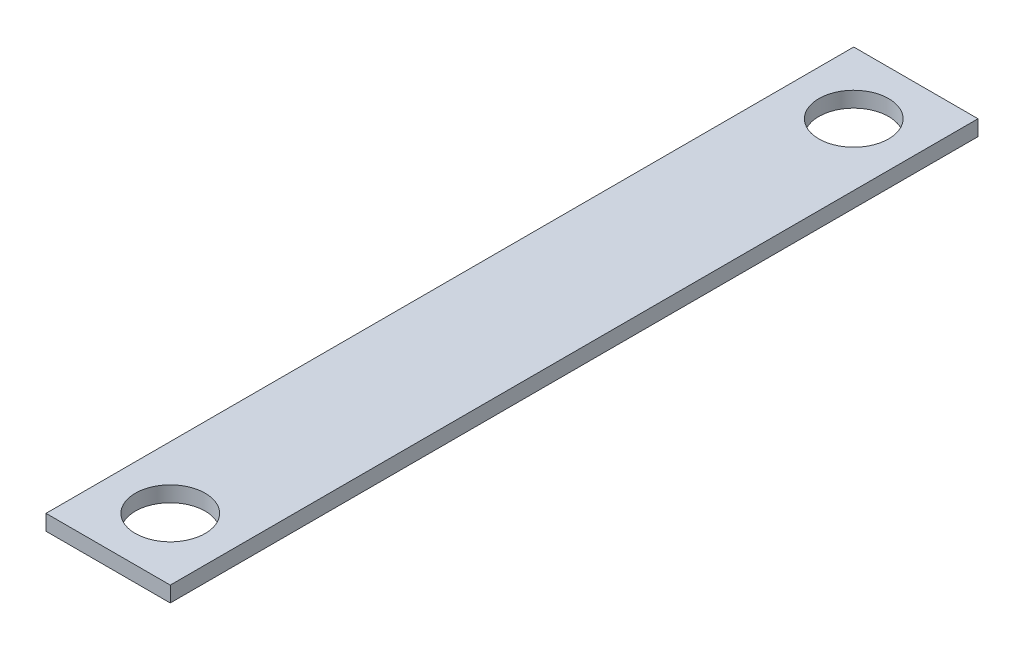
ISO-10303-21;
HEADER;
FILE_DESCRIPTION(('STEP AP214'),'2;1');
FILE_NAME('part.step','',(''),(''),'','','');
FILE_SCHEMA(('AUTOMOTIVE_DESIGN { 1 0 10303 214 1 1 1 1 }'));
ENDSEC;
DATA;
#1=APPLICATION_CONTEXT('core data for automotive mechanical design processes');
#2=APPLICATION_PROTOCOL_DEFINITION('international standard','automotive_design',2000,#1);
#3=PRODUCT_CONTEXT('',#1,'mechanical');
#4=PRODUCT('Part','Part','',(#3));
#5=PRODUCT_RELATED_PRODUCT_CATEGORY('part','',(#4));
#6=PRODUCT_DEFINITION_FORMATION('','',#4);
#7=PRODUCT_DEFINITION_CONTEXT('part definition',#1,'design');
#8=PRODUCT_DEFINITION('design','',#6,#7);
#9=PRODUCT_DEFINITION_SHAPE('','',#8);
#10=(LENGTH_UNIT() NAMED_UNIT(*) SI_UNIT(.MILLI.,.METRE.));
#11=(NAMED_UNIT(*) PLANE_ANGLE_UNIT() SI_UNIT($,.RADIAN.));
#12=(NAMED_UNIT(*) SI_UNIT($,.STERADIAN.) SOLID_ANGLE_UNIT());
#13=UNCERTAINTY_MEASURE_WITH_UNIT(LENGTH_MEASURE(1.E-05),#10,'distance_accuracy_value','');
#14=(GEOMETRIC_REPRESENTATION_CONTEXT(3) GLOBAL_UNCERTAINTY_ASSIGNED_CONTEXT((#13)) GLOBAL_UNIT_ASSIGNED_CONTEXT((#10,
#11,#12)) REPRESENTATION_CONTEXT('',''));
#15=CARTESIAN_POINT('',(0.,0.,0.));
#16=DIRECTION('',(0.,0.,1.));
#17=DIRECTION('',(1.,0.,0.));
#18=AXIS2_PLACEMENT_3D('',#15,#16,#17);
#19=CARTESIAN_POINT('',(0.,6.35,0.));
#20=DIRECTION('',(-1.,0.,0.));
#21=DIRECTION('',(0.,0.,1.));
#22=AXIS2_PLACEMENT_3D('',#19,#20,#21);
#23=PLANE('',#22);
#24=DIRECTION('',(0.,0.,-1.));
#25=VECTOR('',#24,1.);
#26=CARTESIAN_POINT('',(0.,0.,0.));
#27=LINE('',#26,#25);
#28=CARTESIAN_POINT('',(0.,0.,0.));
#29=VERTEX_POINT('',#28);
#30=CARTESIAN_POINT('',(0.,0.,-330.2));
#31=VERTEX_POINT('',#30);
#32=EDGE_CURVE('E109',#29,#31,#27,.T.);
#33=ORIENTED_EDGE('',*,*,#32,.F.);
#34=DIRECTION('',(0.,-1.,0.));
#35=VECTOR('',#34,1.);
#36=CARTESIAN_POINT('',(0.,6.35,0.));
#37=LINE('',#36,#35);
#38=CARTESIAN_POINT('',(0.,6.35,0.));
#39=VERTEX_POINT('',#38);
#40=EDGE_CURVE('E11',#39,#29,#37,.T.);
#41=ORIENTED_EDGE('',*,*,#40,.F.);
#42=DIRECTION('',(0.,0.,-1.));
#43=VECTOR('',#42,1.);
#44=CARTESIAN_POINT('',(0.,6.35,0.));
#45=LINE('',#44,#43);
#46=CARTESIAN_POINT('',(0.,6.35,-330.2));
#47=VERTEX_POINT('',#46);
#48=EDGE_CURVE('E89',#39,#47,#45,.T.);
#49=ORIENTED_EDGE('',*,*,#48,.T.);
#50=DIRECTION('',(0.,-1.,0.));
#51=VECTOR('',#50,1.);
#52=CARTESIAN_POINT('',(0.,6.35,-330.2));
#53=LINE('',#52,#51);
#54=EDGE_CURVE('E50',#47,#31,#53,.T.);
#55=ORIENTED_EDGE('',*,*,#54,.T.);
#56=EDGE_LOOP('',(#33,#41,#49,#55));
#57=FACE_BOUND('',#56,.T.);
#58=ADVANCED_FACE('F33',(#57),#23,.T.);
#59=CARTESIAN_POINT('',(0.,6.35,0.));
#60=DIRECTION('',(0.,0.,-1.));
#61=DIRECTION('',(-1.,0.,0.));
#62=AXIS2_PLACEMENT_3D('',#59,#60,#61);
#63=PLANE('',#62);
#64=DIRECTION('',(1.,0.,0.));
#65=VECTOR('',#64,1.);
#66=CARTESIAN_POINT('',(0.,0.,0.));
#67=LINE('',#66,#65);
#68=CARTESIAN_POINT('',(50.8,0.,0.));
#69=VERTEX_POINT('',#68);
#70=EDGE_CURVE('E94',#29,#69,#67,.T.);
#71=ORIENTED_EDGE('',*,*,#70,.T.);
#72=DIRECTION('',(0.,-1.,0.));
#73=VECTOR('',#72,1.);
#74=CARTESIAN_POINT('',(50.8,6.35,0.));
#75=LINE('',#74,#73);
#76=CARTESIAN_POINT('',(50.8,6.35,0.));
#77=VERTEX_POINT('',#76);
#78=EDGE_CURVE('E42',#77,#69,#75,.T.);
#79=ORIENTED_EDGE('',*,*,#78,.F.);
#80=DIRECTION('',(1.,0.,0.));
#81=VECTOR('',#80,1.);
#82=CARTESIAN_POINT('',(0.,6.35,0.));
#83=LINE('',#82,#81);
#84=EDGE_CURVE('E84',#39,#77,#83,.T.);
#85=ORIENTED_EDGE('',*,*,#84,.F.);
#86=ORIENTED_EDGE('',*,*,#40,.T.);
#87=EDGE_LOOP('',(#71,#79,#85,#86));
#88=FACE_BOUND('',#87,.T.);
#89=ADVANCED_FACE('F92',(#88),#63,.F.);
#90=CARTESIAN_POINT('',(50.8,6.35,0.));
#91=DIRECTION('',(-1.,0.,0.));
#92=DIRECTION('',(0.,0.,1.));
#93=AXIS2_PLACEMENT_3D('',#90,#91,#92);
#94=PLANE('',#93);
#95=DIRECTION('',(0.,0.,-1.));
#96=VECTOR('',#95,1.);
#97=CARTESIAN_POINT('',(50.8,0.,0.));
#98=LINE('',#97,#96);
#99=CARTESIAN_POINT('',(50.8,0.,-330.2));
#100=VERTEX_POINT('',#99);
#101=EDGE_CURVE('E106',#69,#100,#98,.T.);
#102=ORIENTED_EDGE('',*,*,#101,.T.);
#103=DIRECTION('',(0.,-1.,0.));
#104=VECTOR('',#103,1.);
#105=CARTESIAN_POINT('',(50.8,6.35,-330.2));
#106=LINE('',#105,#104);
#107=CARTESIAN_POINT('',(50.8,6.35,-330.2));
#108=VERTEX_POINT('',#107);
#109=EDGE_CURVE('E64',#108,#100,#106,.T.);
#110=ORIENTED_EDGE('',*,*,#109,.F.);
#111=DIRECTION('',(0.,0.,-1.));
#112=VECTOR('',#111,1.);
#113=CARTESIAN_POINT('',(50.8,6.35,0.));
#114=LINE('',#113,#112);
#115=EDGE_CURVE('E76',#77,#108,#114,.T.);
#116=ORIENTED_EDGE('',*,*,#115,.F.);
#117=ORIENTED_EDGE('',*,*,#78,.T.);
#118=EDGE_LOOP('',(#102,#110,#116,#117));
#119=FACE_BOUND('',#118,.T.);
#120=ADVANCED_FACE('F78',(#119),#94,.F.);
#121=CARTESIAN_POINT('',(0.,6.35,-330.2));
#122=DIRECTION('',(0.,0.,-1.));
#123=DIRECTION('',(-1.,0.,0.));
#124=AXIS2_PLACEMENT_3D('',#121,#122,#123);
#125=PLANE('',#124);
#126=DIRECTION('',(1.,0.,0.));
#127=VECTOR('',#126,1.);
#128=CARTESIAN_POINT('',(0.,0.,-330.2));
#129=LINE('',#128,#127);
#130=EDGE_CURVE('E103',#31,#100,#129,.T.);
#131=ORIENTED_EDGE('',*,*,#130,.F.);
#132=ORIENTED_EDGE('',*,*,#54,.F.);
#133=DIRECTION('',(1.,0.,0.));
#134=VECTOR('',#133,1.);
#135=CARTESIAN_POINT('',(0.,6.35,-330.2));
#136=LINE('',#135,#134);
#137=EDGE_CURVE('E83',#47,#108,#136,.T.);
#138=ORIENTED_EDGE('',*,*,#137,.T.);
#139=ORIENTED_EDGE('',*,*,#109,.T.);
#140=EDGE_LOOP('',(#131,#132,#138,#139));
#141=FACE_BOUND('',#140,.T.);
#142=ADVANCED_FACE('F143',(#141),#125,.T.);
#143=CARTESIAN_POINT('',(25.4,6.35,-25.4));
#144=DIRECTION('',(0.,-1.,0.));
#145=DIRECTION('',(0.,0.,-1.));
#146=AXIS2_PLACEMENT_3D('',#143,#144,#145);
#147=CYLINDRICAL_SURFACE('',#146,14.2748);
#148=CARTESIAN_POINT('',(25.4,6.35,-25.4));
#149=DIRECTION('',(0.,1.,0.));
#150=DIRECTION('',(0.,0.,1.));
#151=AXIS2_PLACEMENT_3D('',#148,#149,#150);
#152=CIRCLE('',#151,14.2748);
#153=CARTESIAN_POINT('',(25.4,6.35,-11.1252));
#154=VERTEX_POINT('',#153);
#155=EDGE_CURVE('E102',#154,#154,#152,.T.);
#156=ORIENTED_EDGE('',*,*,#155,.T.);
#157=EDGE_LOOP('',(#156));
#158=FACE_BOUND('',#157,.T.);
#159=CARTESIAN_POINT('',(25.4,0.,-25.4));
#160=DIRECTION('',(0.,1.,0.));
#161=DIRECTION('',(0.,0.,1.));
#162=AXIS2_PLACEMENT_3D('',#159,#160,#161);
#163=CIRCLE('',#162,14.2748);
#164=CARTESIAN_POINT('',(25.4,0.,-11.1252));
#165=VERTEX_POINT('',#164);
#166=EDGE_CURVE('E111',#165,#165,#163,.T.);
#167=ORIENTED_EDGE('',*,*,#166,.F.);
#168=EDGE_LOOP('',(#167));
#169=FACE_BOUND('',#168,.T.);
#170=ADVANCED_FACE('F35',(#158,#169),#147,.F.);
#171=CARTESIAN_POINT('',(25.4,6.35,-304.8));
#172=DIRECTION('',(0.,-1.,0.));
#173=DIRECTION('',(0.,0.,-1.));
#174=AXIS2_PLACEMENT_3D('',#171,#172,#173);
#175=CYLINDRICAL_SURFACE('',#174,14.2748);
#176=CARTESIAN_POINT('',(25.4,6.35,-304.8));
#177=DIRECTION('',(0.,1.,0.));
#178=DIRECTION('',(0.,0.,1.));
#179=AXIS2_PLACEMENT_3D('',#176,#177,#178);
#180=CIRCLE('',#179,14.2748);
#181=CARTESIAN_POINT('',(25.4,6.35,-290.5252));
#182=VERTEX_POINT('',#181);
#183=EDGE_CURVE('E98',#182,#182,#180,.F.);
#184=ORIENTED_EDGE('',*,*,#183,.F.);
#185=EDGE_LOOP('',(#184));
#186=FACE_BOUND('',#185,.T.);
#187=CARTESIAN_POINT('',(25.4,0.,-304.8));
#188=DIRECTION('',(0.,1.,0.));
#189=DIRECTION('',(0.,0.,1.));
#190=AXIS2_PLACEMENT_3D('',#187,#188,#189);
#191=CIRCLE('',#190,14.2748);
#192=CARTESIAN_POINT('',(25.4,0.,-290.5252));
#193=VERTEX_POINT('',#192);
#194=EDGE_CURVE('E99',#193,#193,#191,.F.);
#195=ORIENTED_EDGE('',*,*,#194,.T.);
#196=EDGE_LOOP('',(#195));
#197=FACE_BOUND('',#196,.T.);
#198=ADVANCED_FACE('F125',(#186,#197),#175,.F.);
#199=CARTESIAN_POINT('',(0.,6.35,0.));
#200=DIRECTION('',(0.,1.,0.));
#201=DIRECTION('',(0.,0.,1.));
#202=AXIS2_PLACEMENT_3D('',#199,#200,#201);
#203=PLANE('',#202);
#204=ORIENTED_EDGE('',*,*,#155,.F.);
#205=EDGE_LOOP('',(#204));
#206=FACE_BOUND('',#205,.T.);
#207=ORIENTED_EDGE('',*,*,#48,.F.);
#208=ORIENTED_EDGE('',*,*,#84,.T.);
#209=ORIENTED_EDGE('',*,*,#115,.T.);
#210=ORIENTED_EDGE('',*,*,#137,.F.);
#211=EDGE_LOOP('',(#207,#208,#209,#210));
#212=FACE_BOUND('',#211,.T.);
#213=ORIENTED_EDGE('',*,*,#183,.T.);
#214=EDGE_LOOP('',(#213));
#215=FACE_BOUND('',#214,.T.);
#216=ADVANCED_FACE('F87',(#206,#212,#215),#203,.T.);
#217=CARTESIAN_POINT('',(0.,0.,0.));
#218=DIRECTION('',(0.,1.,0.));
#219=DIRECTION('',(0.,0.,1.));
#220=AXIS2_PLACEMENT_3D('',#217,#218,#219);
#221=PLANE('',#220);
#222=ORIENTED_EDGE('',*,*,#166,.T.);
#223=EDGE_LOOP('',(#222));
#224=FACE_BOUND('',#223,.T.);
#225=ORIENTED_EDGE('',*,*,#32,.T.);
#226=ORIENTED_EDGE('',*,*,#130,.T.);
#227=ORIENTED_EDGE('',*,*,#101,.F.);
#228=ORIENTED_EDGE('',*,*,#70,.F.);
#229=EDGE_LOOP('',(#225,#226,#227,#228));
#230=FACE_BOUND('',#229,.T.);
#231=ORIENTED_EDGE('',*,*,#194,.F.);
#232=EDGE_LOOP('',(#231));
#233=FACE_BOUND('',#232,.T.);
#234=ADVANCED_FACE('F124',(#224,#230,#233),#221,.F.);
#235=CLOSED_SHELL('',(#58,#89,#120,#142,#170,#198,#216,#234));
#236=MANIFOLD_SOLID_BREP('B2',#235);
#237=ADVANCED_BREP_SHAPE_REPRESENTATION('',(#18,#236),#14);
#238=SHAPE_DEFINITION_REPRESENTATION(#9,#237);
ENDSEC;
END-ISO-10303-21;
